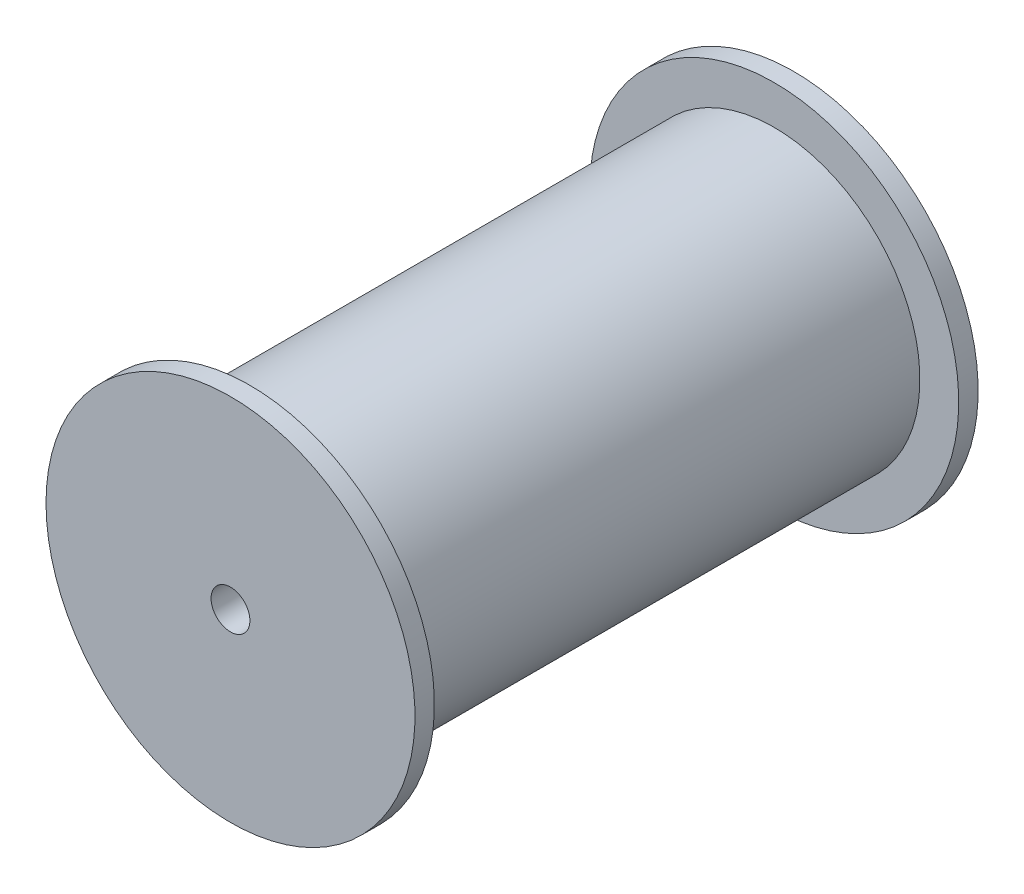
ISO-10303-21;
HEADER;
FILE_DESCRIPTION(('STEP AP214'),'2;1');
FILE_NAME('part.step','',(''),(''),'','','');
FILE_SCHEMA(('AUTOMOTIVE_DESIGN { 1 0 10303 214 1 1 1 1 }'));
ENDSEC;
DATA;
#1=APPLICATION_CONTEXT('core data for automotive mechanical design processes');
#2=APPLICATION_PROTOCOL_DEFINITION('international standard','automotive_design',2000,#1);
#3=PRODUCT_CONTEXT('',#1,'mechanical');
#4=PRODUCT('Part','Part','',(#3));
#5=PRODUCT_RELATED_PRODUCT_CATEGORY('part','',(#4));
#6=PRODUCT_DEFINITION_FORMATION('','',#4);
#7=PRODUCT_DEFINITION_CONTEXT('part definition',#1,'design');
#8=PRODUCT_DEFINITION('design','',#6,#7);
#9=PRODUCT_DEFINITION_SHAPE('','',#8);
#10=(LENGTH_UNIT() NAMED_UNIT(*) SI_UNIT(.MILLI.,.METRE.));
#11=(NAMED_UNIT(*) PLANE_ANGLE_UNIT() SI_UNIT($,.RADIAN.));
#12=(NAMED_UNIT(*) SI_UNIT($,.STERADIAN.) SOLID_ANGLE_UNIT());
#13=UNCERTAINTY_MEASURE_WITH_UNIT(LENGTH_MEASURE(1.E-05),#10,'distance_accuracy_value','');
#14=(GEOMETRIC_REPRESENTATION_CONTEXT(3) GLOBAL_UNCERTAINTY_ASSIGNED_CONTEXT((#13)) GLOBAL_UNIT_ASSIGNED_CONTEXT((#10,
#11,#12)) REPRESENTATION_CONTEXT('',''));
#15=CARTESIAN_POINT('',(0.,0.,0.));
#16=DIRECTION('',(0.,0.,1.));
#17=DIRECTION('',(1.,0.,0.));
#18=AXIS2_PLACEMENT_3D('',#15,#16,#17);
#19=CARTESIAN_POINT('',(679.894917120642,52.8157017452683,-259.556360518351));
#20=DIRECTION('',(0.,0.,-1.));
#21=DIRECTION('',(-1.,0.,0.));
#22=AXIS2_PLACEMENT_3D('',#19,#20,#21);
#23=CYLINDRICAL_SURFACE('',#22,1.);
#24=CARTESIAN_POINT('',(679.894917120642,52.8157017452683,-260.556360518351));
#25=DIRECTION('',(0.,0.,-1.));
#26=DIRECTION('',(-1.,0.,0.));
#27=AXIS2_PLACEMENT_3D('',#24,#25,#26);
#28=CIRCLE('',#27,1.);
#29=CARTESIAN_POINT('',(678.894917120642,52.8157017452683,-260.556360518351));
#30=VERTEX_POINT('',#29);
#31=EDGE_CURVE('E39',#30,#30,#28,.F.);
#32=ORIENTED_EDGE('',*,*,#31,.F.);
#33=EDGE_LOOP('',(#32));
#34=FACE_BOUND('',#33,.T.);
#35=CARTESIAN_POINT('',(679.894917120642,52.8157017452683,-231.556360518351));
#36=DIRECTION('',(0.,0.,-1.));
#37=DIRECTION('',(-1.,0.,0.));
#38=AXIS2_PLACEMENT_3D('',#35,#36,#37);
#39=CIRCLE('',#38,1.);
#40=CARTESIAN_POINT('',(678.894917120642,52.8157017452683,-231.556360518351));
#41=VERTEX_POINT('',#40);
#42=EDGE_CURVE('E17',#41,#41,#39,.F.);
#43=ORIENTED_EDGE('',*,*,#42,.T.);
#44=EDGE_LOOP('',(#43));
#45=FACE_BOUND('',#44,.T.);
#46=ADVANCED_FACE('F14',(#34,#45),#23,.F.);
#47=CARTESIAN_POINT('',(680.551009637852,60.6057776708379,-231.556360518351));
#48=DIRECTION('',(0.,0.,-1.));
#49=DIRECTION('',(-1.,0.,0.));
#50=AXIS2_PLACEMENT_3D('',#47,#48,#49);
#51=PLANE('',#50);
#52=ORIENTED_EDGE('',*,*,#42,.F.);
#53=EDGE_LOOP('',(#52));
#54=FACE_BOUND('',#53,.T.);
#55=CARTESIAN_POINT('',(679.894917120642,52.8157017452683,-231.556360518351));
#56=DIRECTION('',(0.,0.,-1.));
#57=DIRECTION('',(-1.,0.,0.));
#58=AXIS2_PLACEMENT_3D('',#55,#56,#57);
#59=CIRCLE('',#58,9.5);
#60=CARTESIAN_POINT('',(670.394917120642,52.8157017452683,-231.556360518351));
#61=VERTEX_POINT('',#60);
#62=EDGE_CURVE('E37',#61,#61,#59,.T.);
#63=ORIENTED_EDGE('',*,*,#62,.F.);
#64=EDGE_LOOP('',(#63));
#65=FACE_BOUND('',#64,.T.);
#66=ADVANCED_FACE('F47',(#54,#65),#51,.F.);
#67=CARTESIAN_POINT('',(680.551009637852,60.6057776708379,-260.556360518351));
#68=DIRECTION('',(0.,0.,-1.));
#69=DIRECTION('',(-1.,0.,0.));
#70=AXIS2_PLACEMENT_3D('',#67,#68,#69);
#71=PLANE('',#70);
#72=ORIENTED_EDGE('',*,*,#31,.T.);
#73=EDGE_LOOP('',(#72));
#74=FACE_BOUND('',#73,.T.);
#75=CARTESIAN_POINT('',(679.894917120642,52.8157017452683,-260.556360518351));
#76=DIRECTION('',(0.,0.,-1.));
#77=DIRECTION('',(-1.,0.,0.));
#78=AXIS2_PLACEMENT_3D('',#75,#76,#77);
#79=CIRCLE('',#78,9.5);
#80=CARTESIAN_POINT('',(670.394917120642,52.8157017452683,-260.556360518351));
#81=VERTEX_POINT('',#80);
#82=EDGE_CURVE('E34',#81,#81,#79,.F.);
#83=ORIENTED_EDGE('',*,*,#82,.F.);
#84=EDGE_LOOP('',(#83));
#85=FACE_BOUND('',#84,.T.);
#86=ADVANCED_FACE('F50',(#74,#85),#71,.T.);
#87=CARTESIAN_POINT('',(679.894917120642,52.8157017452683,-231.556360518351));
#88=DIRECTION('',(0.,0.,-1.));
#89=DIRECTION('',(-1.,0.,0.));
#90=AXIS2_PLACEMENT_3D('',#87,#88,#89);
#91=CYLINDRICAL_SURFACE('',#90,9.5);
#92=CARTESIAN_POINT('',(679.894917120642,52.8157017452683,-232.556360518351));
#93=DIRECTION('',(0.,0.,-1.));
#94=DIRECTION('',(-1.,0.,0.));
#95=AXIS2_PLACEMENT_3D('',#92,#93,#94);
#96=CIRCLE('',#95,9.5);
#97=CARTESIAN_POINT('',(670.394917120642,52.8157017452683,-232.556360518351));
#98=VERTEX_POINT('',#97);
#99=EDGE_CURVE('E31',#98,#98,#96,.T.);
#100=ORIENTED_EDGE('',*,*,#99,.F.);
#101=EDGE_LOOP('',(#100));
#102=FACE_BOUND('',#101,.T.);
#103=ORIENTED_EDGE('',*,*,#62,.T.);
#104=EDGE_LOOP('',(#103));
#105=FACE_BOUND('',#104,.T.);
#106=ADVANCED_FACE('F53',(#102,#105),#91,.T.);
#107=CARTESIAN_POINT('',(679.894917120642,52.8157017452683,-259.556360518351));
#108=DIRECTION('',(0.,0.,-1.));
#109=DIRECTION('',(-1.,0.,0.));
#110=AXIS2_PLACEMENT_3D('',#107,#108,#109);
#111=CYLINDRICAL_SURFACE('',#110,9.5);
#112=CARTESIAN_POINT('',(679.894917120642,52.8157017452683,-259.556360518351));
#113=DIRECTION('',(0.,0.,-1.));
#114=DIRECTION('',(-1.,0.,0.));
#115=AXIS2_PLACEMENT_3D('',#112,#113,#114);
#116=CIRCLE('',#115,9.5);
#117=CARTESIAN_POINT('',(670.394917120642,52.8157017452683,-259.556360518351));
#118=VERTEX_POINT('',#117);
#119=EDGE_CURVE('E26',#118,#118,#116,.T.);
#120=ORIENTED_EDGE('',*,*,#119,.T.);
#121=EDGE_LOOP('',(#120));
#122=FACE_BOUND('',#121,.T.);
#123=ORIENTED_EDGE('',*,*,#82,.T.);
#124=EDGE_LOOP('',(#123));
#125=FACE_BOUND('',#124,.T.);
#126=ADVANCED_FACE('F55',(#122,#125),#111,.T.);
#127=CARTESIAN_POINT('',(680.551009637852,60.6057776708379,-232.556360518351));
#128=DIRECTION('',(0.,0.,-1.));
#129=DIRECTION('',(-1.,0.,0.));
#130=AXIS2_PLACEMENT_3D('',#127,#128,#129);
#131=PLANE('',#130);
#132=CARTESIAN_POINT('',(679.894917120642,52.8157017452683,-232.556360518351));
#133=DIRECTION('',(0.,0.,-1.));
#134=DIRECTION('',(-1.,0.,0.));
#135=AXIS2_PLACEMENT_3D('',#132,#133,#134);
#136=CIRCLE('',#135,7.5);
#137=CARTESIAN_POINT('',(672.394917120642,52.8157017452683,-232.556360518351));
#138=VERTEX_POINT('',#137);
#139=EDGE_CURVE('E21',#138,#138,#136,.T.);
#140=ORIENTED_EDGE('',*,*,#139,.F.);
#141=EDGE_LOOP('',(#140));
#142=FACE_BOUND('',#141,.T.);
#143=ORIENTED_EDGE('',*,*,#99,.T.);
#144=EDGE_LOOP('',(#143));
#145=FACE_BOUND('',#144,.T.);
#146=ADVANCED_FACE('F63',(#142,#145),#131,.T.);
#147=CARTESIAN_POINT('',(680.551009637852,60.6057776708379,-259.556360518351));
#148=DIRECTION('',(0.,0.,-1.));
#149=DIRECTION('',(-1.,0.,0.));
#150=AXIS2_PLACEMENT_3D('',#147,#148,#149);
#151=PLANE('',#150);
#152=CARTESIAN_POINT('',(679.894917120642,52.8157017452683,-259.556360518351));
#153=DIRECTION('',(0.,0.,-1.));
#154=DIRECTION('',(-1.,0.,0.));
#155=AXIS2_PLACEMENT_3D('',#152,#153,#154);
#156=CIRCLE('',#155,7.5);
#157=CARTESIAN_POINT('',(672.394917120642,52.8157017452683,-259.556360518351));
#158=VERTEX_POINT('',#157);
#159=EDGE_CURVE('E9',#158,#158,#156,.F.);
#160=ORIENTED_EDGE('',*,*,#159,.F.);
#161=EDGE_LOOP('',(#160));
#162=FACE_BOUND('',#161,.T.);
#163=ORIENTED_EDGE('',*,*,#119,.F.);
#164=EDGE_LOOP('',(#163));
#165=FACE_BOUND('',#164,.T.);
#166=ADVANCED_FACE('F70',(#162,#165),#151,.F.);
#167=CARTESIAN_POINT('',(679.894917120642,52.8157017452683,-259.556360518351));
#168=DIRECTION('',(0.,0.,-1.));
#169=DIRECTION('',(-1.,0.,0.));
#170=AXIS2_PLACEMENT_3D('',#167,#168,#169);
#171=CYLINDRICAL_SURFACE('',#170,7.5);
#172=ORIENTED_EDGE('',*,*,#159,.T.);
#173=EDGE_LOOP('',(#172));
#174=FACE_BOUND('',#173,.T.);
#175=ORIENTED_EDGE('',*,*,#139,.T.);
#176=EDGE_LOOP('',(#175));
#177=FACE_BOUND('',#176,.T.);
#178=ADVANCED_FACE('F68',(#174,#177),#171,.T.);
#179=CLOSED_SHELL('',(#46,#66,#86,#106,#126,#146,#166,#178));
#180=MANIFOLD_SOLID_BREP('B1',#179);
#181=ADVANCED_BREP_SHAPE_REPRESENTATION('',(#18,#180),#14);
#182=SHAPE_DEFINITION_REPRESENTATION(#9,#181);
ENDSEC;
END-ISO-10303-21;
